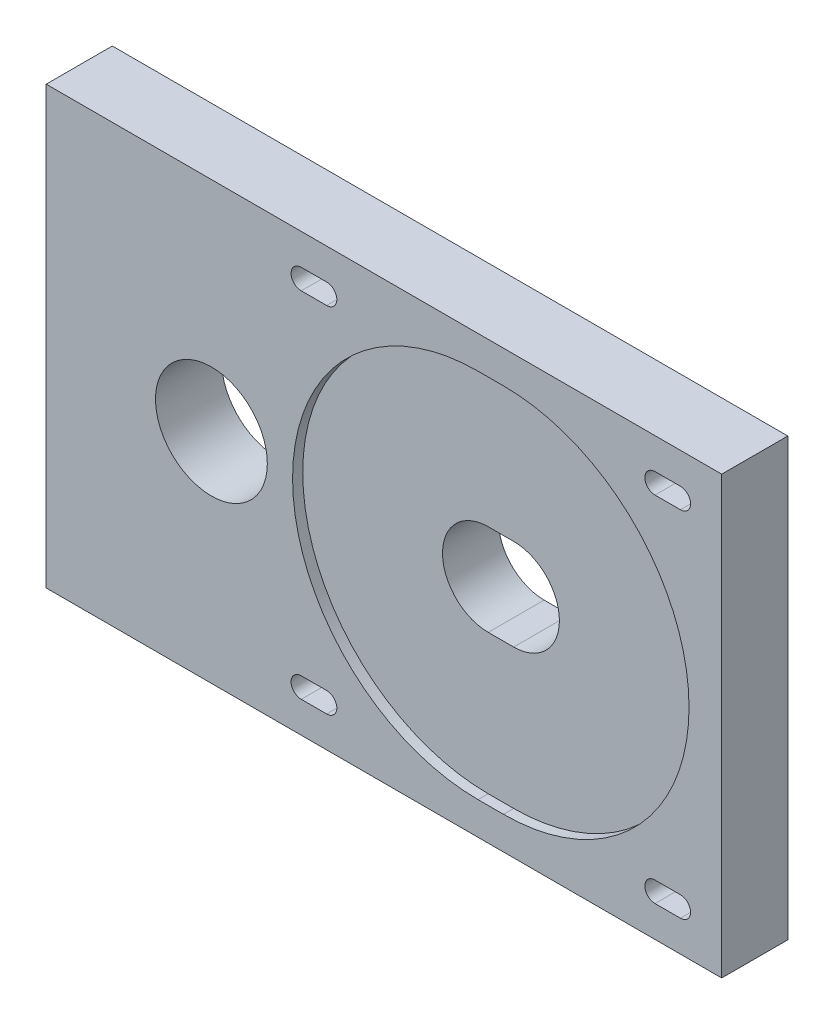
ISO-10303-21;
HEADER;
FILE_DESCRIPTION(('STEP AP214'),'2;1');
FILE_NAME('part.step','',(''),(''),'','','');
FILE_SCHEMA(('AUTOMOTIVE_DESIGN { 1 0 10303 214 1 1 1 1 }'));
ENDSEC;
DATA;
#1=APPLICATION_CONTEXT('core data for automotive mechanical design processes');
#2=APPLICATION_PROTOCOL_DEFINITION('international standard','automotive_design',2000,#1);
#3=PRODUCT_CONTEXT('',#1,'mechanical');
#4=PRODUCT('Part','Part','',(#3));
#5=PRODUCT_RELATED_PRODUCT_CATEGORY('part','',(#4));
#6=PRODUCT_DEFINITION_FORMATION('','',#4);
#7=PRODUCT_DEFINITION_CONTEXT('part definition',#1,'design');
#8=PRODUCT_DEFINITION('design','',#6,#7);
#9=PRODUCT_DEFINITION_SHAPE('','',#8);
#10=(LENGTH_UNIT() NAMED_UNIT(*) SI_UNIT(.MILLI.,.METRE.));
#11=(NAMED_UNIT(*) PLANE_ANGLE_UNIT() SI_UNIT($,.RADIAN.));
#12=(NAMED_UNIT(*) SI_UNIT($,.STERADIAN.) SOLID_ANGLE_UNIT());
#13=UNCERTAINTY_MEASURE_WITH_UNIT(LENGTH_MEASURE(1.E-05),#10,'distance_accuracy_value','');
#14=(GEOMETRIC_REPRESENTATION_CONTEXT(3) GLOBAL_UNCERTAINTY_ASSIGNED_CONTEXT((#13)) GLOBAL_UNIT_ASSIGNED_CONTEXT((#10,
#11,#12)) REPRESENTATION_CONTEXT('',''));
#15=CARTESIAN_POINT('',(0.,0.,0.));
#16=DIRECTION('',(0.,0.,1.));
#17=DIRECTION('',(1.,0.,0.));
#18=AXIS2_PLACEMENT_3D('',#15,#16,#17);
#19=CARTESIAN_POINT('',(-66.45,-42.925,13.));
#20=DIRECTION('',(1.,0.,0.));
#21=DIRECTION('',(0.,0.,-1.));
#22=AXIS2_PLACEMENT_3D('',#19,#20,#21);
#23=PLANE('',#22);
#24=CARTESIAN_POINT('',(-66.45,34.925,6.5));
#25=DIRECTION('',(-1.,0.,0.));
#26=DIRECTION('',(0.,0.,1.));
#27=AXIS2_PLACEMENT_3D('',#24,#25,#26);
#28=CIRCLE('',#27,3.);
#29=CARTESIAN_POINT('',(-66.45,34.925,9.5));
#30=VERTEX_POINT('',#29);
#31=EDGE_CURVE('E484',#30,#30,#28,.T.);
#32=ORIENTED_EDGE('',*,*,#31,.F.);
#33=EDGE_LOOP('',(#32));
#34=FACE_BOUND('',#33,.T.);
#35=CARTESIAN_POINT('',(-66.45,-34.925,6.5));
#36=DIRECTION('',(-1.,0.,0.));
#37=DIRECTION('',(0.,0.,1.));
#38=AXIS2_PLACEMENT_3D('',#35,#36,#37);
#39=CIRCLE('',#38,3.);
#40=CARTESIAN_POINT('',(-66.45,-34.925,9.5));
#41=VERTEX_POINT('',#40);
#42=EDGE_CURVE('E488',#41,#41,#39,.T.);
#43=ORIENTED_EDGE('',*,*,#42,.F.);
#44=EDGE_LOOP('',(#43));
#45=FACE_BOUND('',#44,.T.);
#46=DIRECTION('',(0.,-1.,0.));
#47=VECTOR('',#46,1.);
#48=CARTESIAN_POINT('',(-66.45,-42.925,0.));
#49=LINE('',#48,#47);
#50=CARTESIAN_POINT('',(-66.45,42.925,0.));
#51=VERTEX_POINT('',#50);
#52=CARTESIAN_POINT('',(-66.45,-42.925,0.));
#53=VERTEX_POINT('',#52);
#54=EDGE_CURVE('E401',#51,#53,#49,.T.);
#55=ORIENTED_EDGE('',*,*,#54,.T.);
#56=DIRECTION('',(0.,0.,-1.));
#57=VECTOR('',#56,1.);
#58=CARTESIAN_POINT('',(-66.45,-42.925,13.));
#59=LINE('',#58,#57);
#60=CARTESIAN_POINT('',(-66.45,-42.925,13.));
#61=VERTEX_POINT('',#60);
#62=EDGE_CURVE('E449',#61,#53,#59,.T.);
#63=ORIENTED_EDGE('',*,*,#62,.F.);
#64=DIRECTION('',(0.,-1.,0.));
#65=VECTOR('',#64,1.);
#66=CARTESIAN_POINT('',(-66.45,-42.925,13.));
#67=LINE('',#66,#65);
#68=CARTESIAN_POINT('',(-66.45,42.925,13.));
#69=VERTEX_POINT('',#68);
#70=EDGE_CURVE('E423',#69,#61,#67,.T.);
#71=ORIENTED_EDGE('',*,*,#70,.F.);
#72=DIRECTION('',(0.,0.,-1.));
#73=VECTOR('',#72,1.);
#74=CARTESIAN_POINT('',(-66.45,42.925,13.));
#75=LINE('',#74,#73);
#76=EDGE_CURVE('E433',#69,#51,#75,.T.);
#77=ORIENTED_EDGE('',*,*,#76,.T.);
#78=EDGE_LOOP('',(#55,#63,#71,#77));
#79=FACE_BOUND('',#78,.T.);
#80=ADVANCED_FACE('F51',(#34,#45,#79),#23,.F.);
#81=CARTESIAN_POINT('',(66.45,-42.925,13.));
#82=DIRECTION('',(0.,1.,0.));
#83=DIRECTION('',(-1.,0.,0.));
#84=AXIS2_PLACEMENT_3D('',#81,#82,#83);
#85=PLANE('',#84);
#86=DIRECTION('',(1.,0.,0.));
#87=VECTOR('',#86,1.);
#88=CARTESIAN_POINT('',(66.45,-42.925,0.));
#89=LINE('',#88,#87);
#90=CARTESIAN_POINT('',(66.45,-42.925,0.));
#91=VERTEX_POINT('',#90);
#92=EDGE_CURVE('E436',#53,#91,#89,.T.);
#93=ORIENTED_EDGE('',*,*,#92,.T.);
#94=DIRECTION('',(0.,0.,-1.));
#95=VECTOR('',#94,1.);
#96=CARTESIAN_POINT('',(66.45,-42.925,13.));
#97=LINE('',#96,#95);
#98=CARTESIAN_POINT('',(66.45,-42.925,13.));
#99=VERTEX_POINT('',#98);
#100=EDGE_CURVE('E446',#99,#91,#97,.T.);
#101=ORIENTED_EDGE('',*,*,#100,.F.);
#102=DIRECTION('',(1.,0.,0.));
#103=VECTOR('',#102,1.);
#104=CARTESIAN_POINT('',(66.45,-42.925,13.));
#105=LINE('',#104,#103);
#106=EDGE_CURVE('E426',#61,#99,#105,.T.);
#107=ORIENTED_EDGE('',*,*,#106,.F.);
#108=ORIENTED_EDGE('',*,*,#62,.T.);
#109=EDGE_LOOP('',(#93,#101,#107,#108));
#110=FACE_BOUND('',#109,.T.);
#111=ADVANCED_FACE('F474',(#110),#85,.F.);
#112=CARTESIAN_POINT('',(66.45,-42.925,13.));
#113=DIRECTION('',(-1.,0.,0.));
#114=DIRECTION('',(0.,0.,1.));
#115=AXIS2_PLACEMENT_3D('',#112,#113,#114);
#116=PLANE('',#115);
#117=DIRECTION('',(0.,1.,0.));
#118=VECTOR('',#117,1.);
#119=CARTESIAN_POINT('',(66.45,-42.925,0.));
#120=LINE('',#119,#118);
#121=CARTESIAN_POINT('',(66.45,42.925,0.));
#122=VERTEX_POINT('',#121);
#123=EDGE_CURVE('E438',#91,#122,#120,.T.);
#124=ORIENTED_EDGE('',*,*,#123,.T.);
#125=DIRECTION('',(0.,0.,-1.));
#126=VECTOR('',#125,1.);
#127=CARTESIAN_POINT('',(66.45,42.925,13.));
#128=LINE('',#127,#126);
#129=CARTESIAN_POINT('',(66.45,42.925,13.));
#130=VERTEX_POINT('',#129);
#131=EDGE_CURVE('E443',#130,#122,#128,.T.);
#132=ORIENTED_EDGE('',*,*,#131,.F.);
#133=DIRECTION('',(0.,1.,0.));
#134=VECTOR('',#133,1.);
#135=CARTESIAN_POINT('',(66.45,-42.925,13.));
#136=LINE('',#135,#134);
#137=EDGE_CURVE('E429',#99,#130,#136,.T.);
#138=ORIENTED_EDGE('',*,*,#137,.F.);
#139=ORIENTED_EDGE('',*,*,#100,.T.);
#140=EDGE_LOOP('',(#124,#132,#138,#139));
#141=FACE_BOUND('',#140,.T.);
#142=ADVANCED_FACE('F479',(#141),#116,.F.);
#143=CARTESIAN_POINT('',(66.45,42.925,13.));
#144=DIRECTION('',(0.,-1.,0.));
#145=DIRECTION('',(1.,0.,0.));
#146=AXIS2_PLACEMENT_3D('',#143,#144,#145);
#147=PLANE('',#146);
#148=DIRECTION('',(-1.,0.,0.));
#149=VECTOR('',#148,1.);
#150=CARTESIAN_POINT('',(66.45,42.925,0.));
#151=LINE('',#150,#149);
#152=EDGE_CURVE('E427',#122,#51,#151,.T.);
#153=ORIENTED_EDGE('',*,*,#152,.T.);
#154=ORIENTED_EDGE('',*,*,#76,.F.);
#155=DIRECTION('',(-1.,0.,0.));
#156=VECTOR('',#155,1.);
#157=CARTESIAN_POINT('',(66.45,42.925,13.));
#158=LINE('',#157,#156);
#159=EDGE_CURVE('E431',#130,#69,#158,.T.);
#160=ORIENTED_EDGE('',*,*,#159,.F.);
#161=ORIENTED_EDGE('',*,*,#131,.T.);
#162=EDGE_LOOP('',(#153,#154,#160,#161));
#163=FACE_BOUND('',#162,.T.);
#164=ADVANCED_FACE('F503',(#163),#147,.F.);
#165=CARTESIAN_POINT('',(0.,0.,13.));
#166=DIRECTION('',(0.,0.,1.));
#167=DIRECTION('',(1.,0.,0.));
#168=AXIS2_PLACEMENT_3D('',#165,#166,#167);
#169=PLANE('',#168);
#170=CARTESIAN_POINT('',(-33.95,0.,13.));
#171=DIRECTION('',(0.,0.,1.));
#172=DIRECTION('',(1.,0.,0.));
#173=AXIS2_PLACEMENT_3D('',#170,#171,#172);
#174=CIRCLE('',#173,11.);
#175=CARTESIAN_POINT('',(-22.95,0.,13.));
#176=VERTEX_POINT('',#175);
#177=EDGE_CURVE('E254',#176,#176,#174,.T.);
#178=ORIENTED_EDGE('',*,*,#177,.F.);
#179=EDGE_LOOP('',(#178));
#180=FACE_BOUND('',#179,.T.);
#181=CARTESIAN_POINT('',(-16.275,34.8,13.));
#182=DIRECTION('',(0.,0.,1.));
#183=DIRECTION('',(1.,0.,0.));
#184=AXIS2_PLACEMENT_3D('',#181,#182,#183);
#185=CIRCLE('',#184,2.);
#186=CARTESIAN_POINT('',(-16.275,36.8,13.));
#187=VERTEX_POINT('',#186);
#188=CARTESIAN_POINT('',(-16.275,32.8,13.));
#189=VERTEX_POINT('',#188);
#190=EDGE_CURVE('E280',#187,#189,#185,.T.);
#191=ORIENTED_EDGE('',*,*,#190,.F.);
#192=DIRECTION('',(1.,0.,0.));
#193=VECTOR('',#192,1.);
#194=CARTESIAN_POINT('',(-69.6,36.8,13.));
#195=LINE('',#194,#193);
#196=CARTESIAN_POINT('',(-11.275,36.8,13.));
#197=VERTEX_POINT('',#196);
#198=EDGE_CURVE('E271',#187,#197,#195,.T.);
#199=ORIENTED_EDGE('',*,*,#198,.T.);
#200=CARTESIAN_POINT('',(-11.275,34.8,13.));
#201=DIRECTION('',(0.,0.,1.));
#202=DIRECTION('',(1.,0.,0.));
#203=AXIS2_PLACEMENT_3D('',#200,#201,#202);
#204=CIRCLE('',#203,2.);
#205=CARTESIAN_POINT('',(-11.275,32.8,13.));
#206=VERTEX_POINT('',#205);
#207=EDGE_CURVE('E286',#206,#197,#204,.T.);
#208=ORIENTED_EDGE('',*,*,#207,.F.);
#209=DIRECTION('',(1.,0.,0.));
#210=VECTOR('',#209,1.);
#211=CARTESIAN_POINT('',(-69.6,32.8,13.));
#212=LINE('',#211,#210);
#213=EDGE_CURVE('E282',#189,#206,#212,.T.);
#214=ORIENTED_EDGE('',*,*,#213,.F.);
#215=EDGE_LOOP('',(#191,#199,#208,#214));
#216=FACE_BOUND('',#215,.T.);
#217=CARTESIAN_POINT('',(53.325,-34.8,13.));
#218=DIRECTION('',(0.,0.,1.));
#219=DIRECTION('',(1.,0.,0.));
#220=AXIS2_PLACEMENT_3D('',#217,#218,#219);
#221=CIRCLE('',#220,2.);
#222=CARTESIAN_POINT('',(53.325,-32.8,13.));
#223=VERTEX_POINT('',#222);
#224=CARTESIAN_POINT('',(53.325,-36.8,13.));
#225=VERTEX_POINT('',#224);
#226=EDGE_CURVE('E313',#223,#225,#221,.T.);
#227=ORIENTED_EDGE('',*,*,#226,.F.);
#228=DIRECTION('',(1.,0.,0.));
#229=VECTOR('',#228,1.);
#230=CARTESIAN_POINT('',(0.,-32.8,13.));
#231=LINE('',#230,#229);
#232=CARTESIAN_POINT('',(58.325,-32.8,13.));
#233=VERTEX_POINT('',#232);
#234=EDGE_CURVE('E304',#223,#233,#231,.T.);
#235=ORIENTED_EDGE('',*,*,#234,.T.);
#236=CARTESIAN_POINT('',(58.325,-34.8,13.));
#237=DIRECTION('',(0.,0.,1.));
#238=DIRECTION('',(1.,0.,0.));
#239=AXIS2_PLACEMENT_3D('',#236,#237,#238);
#240=CIRCLE('',#239,2.);
#241=CARTESIAN_POINT('',(58.325,-36.8,13.));
#242=VERTEX_POINT('',#241);
#243=EDGE_CURVE('E319',#242,#233,#240,.T.);
#244=ORIENTED_EDGE('',*,*,#243,.F.);
#245=DIRECTION('',(1.,0.,0.));
#246=VECTOR('',#245,1.);
#247=CARTESIAN_POINT('',(0.,-36.8,13.));
#248=LINE('',#247,#246);
#249=EDGE_CURVE('E315',#225,#242,#248,.T.);
#250=ORIENTED_EDGE('',*,*,#249,.F.);
#251=EDGE_LOOP('',(#227,#235,#244,#250));
#252=FACE_BOUND('',#251,.T.);
#253=CARTESIAN_POINT('',(-16.275,-34.8,13.));
#254=DIRECTION('',(0.,0.,1.));
#255=DIRECTION('',(1.,0.,0.));
#256=AXIS2_PLACEMENT_3D('',#253,#254,#255);
#257=CIRCLE('',#256,2.);
#258=CARTESIAN_POINT('',(-16.275,-32.8,13.));
#259=VERTEX_POINT('',#258);
#260=CARTESIAN_POINT('',(-16.275,-36.8,13.));
#261=VERTEX_POINT('',#260);
#262=EDGE_CURVE('E262',#259,#261,#257,.T.);
#263=ORIENTED_EDGE('',*,*,#262,.F.);
#264=DIRECTION('',(1.,0.,0.));
#265=VECTOR('',#264,1.);
#266=CARTESIAN_POINT('',(-69.6,-32.8,13.));
#267=LINE('',#266,#265);
#268=CARTESIAN_POINT('',(-11.275,-32.8,13.));
#269=VERTEX_POINT('',#268);
#270=EDGE_CURVE('E335',#259,#269,#267,.T.);
#271=ORIENTED_EDGE('',*,*,#270,.T.);
#272=CARTESIAN_POINT('',(-11.275,-34.8,13.));
#273=DIRECTION('',(0.,0.,1.));
#274=DIRECTION('',(1.,0.,0.));
#275=AXIS2_PLACEMENT_3D('',#272,#273,#274);
#276=CIRCLE('',#275,2.);
#277=CARTESIAN_POINT('',(-11.275,-36.8,13.));
#278=VERTEX_POINT('',#277);
#279=EDGE_CURVE('E348',#278,#269,#276,.T.);
#280=ORIENTED_EDGE('',*,*,#279,.F.);
#281=DIRECTION('',(1.,0.,0.));
#282=VECTOR('',#281,1.);
#283=CARTESIAN_POINT('',(-69.6,-36.8,13.));
#284=LINE('',#283,#282);
#285=EDGE_CURVE('E345',#261,#278,#284,.T.);
#286=ORIENTED_EDGE('',*,*,#285,.F.);
#287=EDGE_LOOP('',(#263,#271,#280,#286));
#288=FACE_BOUND('',#287,.T.);
#289=CARTESIAN_POINT('',(53.325,34.8,13.));
#290=DIRECTION('',(0.,0.,1.));
#291=DIRECTION('',(1.,0.,0.));
#292=AXIS2_PLACEMENT_3D('',#289,#290,#291);
#293=CIRCLE('',#292,2.);
#294=CARTESIAN_POINT('',(53.325,36.8,13.));
#295=VERTEX_POINT('',#294);
#296=CARTESIAN_POINT('',(53.325,32.8,13.));
#297=VERTEX_POINT('',#296);
#298=EDGE_CURVE('E293',#295,#297,#293,.T.);
#299=ORIENTED_EDGE('',*,*,#298,.F.);
#300=DIRECTION('',(1.,0.,0.));
#301=VECTOR('',#300,1.);
#302=CARTESIAN_POINT('',(0.,36.8,13.));
#303=LINE('',#302,#301);
#304=CARTESIAN_POINT('',(58.325,36.8,13.));
#305=VERTEX_POINT('',#304);
#306=EDGE_CURVE('E364',#295,#305,#303,.T.);
#307=ORIENTED_EDGE('',*,*,#306,.T.);
#308=CARTESIAN_POINT('',(58.325,34.8,13.));
#309=DIRECTION('',(0.,0.,1.));
#310=DIRECTION('',(1.,0.,0.));
#311=AXIS2_PLACEMENT_3D('',#308,#309,#310);
#312=CIRCLE('',#311,2.);
#313=CARTESIAN_POINT('',(58.325,32.8,13.));
#314=VERTEX_POINT('',#313);
#315=EDGE_CURVE('E377',#314,#305,#312,.T.);
#316=ORIENTED_EDGE('',*,*,#315,.F.);
#317=DIRECTION('',(1.,0.,0.));
#318=VECTOR('',#317,1.);
#319=CARTESIAN_POINT('',(0.,32.8,13.));
#320=LINE('',#319,#318);
#321=EDGE_CURVE('E374',#297,#314,#320,.T.);
#322=ORIENTED_EDGE('',*,*,#321,.F.);
#323=EDGE_LOOP('',(#299,#307,#316,#322));
#324=FACE_BOUND('',#323,.T.);
#325=DIRECTION('',(-1.,0.,0.));
#326=VECTOR('',#325,1.);
#327=CARTESIAN_POINT('',(23.52,36.5,13.));
#328=LINE('',#327,#326);
#329=CARTESIAN_POINT('',(23.52,36.5,13.));
#330=VERTEX_POINT('',#329);
#331=CARTESIAN_POINT('',(18.52,36.5,13.));
#332=VERTEX_POINT('',#331);
#333=EDGE_CURVE('E416',#330,#332,#328,.T.);
#334=ORIENTED_EDGE('',*,*,#333,.F.);
#335=CARTESIAN_POINT('',(23.52,0.,13.));
#336=DIRECTION('',(0.,0.,1.));
#337=DIRECTION('',(1.,0.,0.));
#338=AXIS2_PLACEMENT_3D('',#335,#336,#337);
#339=CIRCLE('',#338,36.5);
#340=CARTESIAN_POINT('',(23.52,-36.5,13.));
#341=VERTEX_POINT('',#340);
#342=EDGE_CURVE('E395',#341,#330,#339,.T.);
#343=ORIENTED_EDGE('',*,*,#342,.F.);
#344=DIRECTION('',(-1.,0.,0.));
#345=VECTOR('',#344,1.);
#346=CARTESIAN_POINT('',(23.52,-36.5,13.));
#347=LINE('',#346,#345);
#348=CARTESIAN_POINT('',(18.52,-36.5,13.));
#349=VERTEX_POINT('',#348);
#350=EDGE_CURVE('E384',#341,#349,#347,.T.);
#351=ORIENTED_EDGE('',*,*,#350,.T.);
#352=CARTESIAN_POINT('',(18.52,0.,13.));
#353=DIRECTION('',(0.,0.,1.));
#354=DIRECTION('',(1.,0.,0.));
#355=AXIS2_PLACEMENT_3D('',#352,#353,#354);
#356=CIRCLE('',#355,36.5);
#357=EDGE_CURVE('E407',#332,#349,#356,.T.);
#358=ORIENTED_EDGE('',*,*,#357,.F.);
#359=EDGE_LOOP('',(#334,#343,#351,#358));
#360=FACE_BOUND('',#359,.T.);
#361=ORIENTED_EDGE('',*,*,#70,.T.);
#362=ORIENTED_EDGE('',*,*,#106,.T.);
#363=ORIENTED_EDGE('',*,*,#137,.T.);
#364=ORIENTED_EDGE('',*,*,#159,.T.);
#365=EDGE_LOOP('',(#361,#362,#363,#364));
#366=FACE_BOUND('',#365,.T.);
#367=ADVANCED_FACE('F499',(#180,#216,#252,#288,#324,#360,#366),#169,.T.);
#368=CARTESIAN_POINT('',(0.,0.,0.));
#369=DIRECTION('',(0.,0.,1.));
#370=DIRECTION('',(1.,0.,0.));
#371=AXIS2_PLACEMENT_3D('',#368,#369,#370);
#372=PLANE('',#371);
#373=CARTESIAN_POINT('',(-33.95,0.,0.));
#374=DIRECTION('',(0.,0.,1.));
#375=DIRECTION('',(1.,0.,0.));
#376=AXIS2_PLACEMENT_3D('',#373,#374,#375);
#377=CIRCLE('',#376,11.);
#378=CARTESIAN_POINT('',(-22.95,0.,0.));
#379=VERTEX_POINT('',#378);
#380=EDGE_CURVE('E251',#379,#379,#377,.T.);
#381=ORIENTED_EDGE('',*,*,#380,.T.);
#382=EDGE_LOOP('',(#381));
#383=FACE_BOUND('',#382,.T.);
#384=CARTESIAN_POINT('',(18.52,0.,0.));
#385=DIRECTION('',(0.,0.,1.));
#386=DIRECTION('',(1.,0.,0.));
#387=AXIS2_PLACEMENT_3D('',#384,#385,#386);
#388=CIRCLE('',#387,9.);
#389=CARTESIAN_POINT('',(18.52,9.,0.));
#390=VERTEX_POINT('',#389);
#391=CARTESIAN_POINT('',(18.52,-9.,0.));
#392=VERTEX_POINT('',#391);
#393=EDGE_CURVE('E239',#390,#392,#388,.T.);
#394=ORIENTED_EDGE('',*,*,#393,.T.);
#395=DIRECTION('',(1.,0.,0.));
#396=VECTOR('',#395,1.);
#397=CARTESIAN_POINT('',(0.,-9.,0.));
#398=LINE('',#397,#396);
#399=CARTESIAN_POINT('',(23.52,-9.,0.));
#400=VERTEX_POINT('',#399);
#401=EDGE_CURVE('E235',#392,#400,#398,.T.);
#402=ORIENTED_EDGE('',*,*,#401,.T.);
#403=CARTESIAN_POINT('',(23.52,0.,0.));
#404=DIRECTION('',(0.,0.,1.));
#405=DIRECTION('',(1.,0.,0.));
#406=AXIS2_PLACEMENT_3D('',#403,#404,#405);
#407=CIRCLE('',#406,9.);
#408=CARTESIAN_POINT('',(23.52,9.,0.));
#409=VERTEX_POINT('',#408);
#410=EDGE_CURVE('E242',#400,#409,#407,.T.);
#411=ORIENTED_EDGE('',*,*,#410,.T.);
#412=DIRECTION('',(1.,0.,0.));
#413=VECTOR('',#412,1.);
#414=CARTESIAN_POINT('',(0.,9.,0.));
#415=LINE('',#414,#413);
#416=EDGE_CURVE('E246',#390,#409,#415,.T.);
#417=ORIENTED_EDGE('',*,*,#416,.F.);
#418=EDGE_LOOP('',(#394,#402,#411,#417));
#419=FACE_BOUND('',#418,.T.);
#420=DIRECTION('',(1.,0.,0.));
#421=VECTOR('',#420,1.);
#422=CARTESIAN_POINT('',(-69.6,36.8,0.));
#423=LINE('',#422,#421);
#424=CARTESIAN_POINT('',(-16.275,36.8,0.));
#425=VERTEX_POINT('',#424);
#426=CARTESIAN_POINT('',(-11.275,36.8,0.));
#427=VERTEX_POINT('',#426);
#428=EDGE_CURVE('E277',#425,#427,#423,.T.);
#429=ORIENTED_EDGE('',*,*,#428,.F.);
#430=CARTESIAN_POINT('',(-16.275,34.8,0.));
#431=DIRECTION('',(0.,0.,1.));
#432=DIRECTION('',(1.,0.,0.));
#433=AXIS2_PLACEMENT_3D('',#430,#431,#432);
#434=CIRCLE('',#433,2.);
#435=CARTESIAN_POINT('',(-16.275,32.8,0.));
#436=VERTEX_POINT('',#435);
#437=EDGE_CURVE('E267',#425,#436,#434,.T.);
#438=ORIENTED_EDGE('',*,*,#437,.T.);
#439=DIRECTION('',(1.,0.,0.));
#440=VECTOR('',#439,1.);
#441=CARTESIAN_POINT('',(-69.6,32.8,0.));
#442=LINE('',#441,#440);
#443=CARTESIAN_POINT('',(-11.275,32.8,0.));
#444=VERTEX_POINT('',#443);
#445=EDGE_CURVE('E270',#436,#444,#442,.T.);
#446=ORIENTED_EDGE('',*,*,#445,.T.);
#447=CARTESIAN_POINT('',(-11.275,34.8,0.));
#448=DIRECTION('',(0.,0.,1.));
#449=DIRECTION('',(1.,0.,0.));
#450=AXIS2_PLACEMENT_3D('',#447,#448,#449);
#451=CIRCLE('',#450,2.);
#452=EDGE_CURVE('E274',#444,#427,#451,.T.);
#453=ORIENTED_EDGE('',*,*,#452,.T.);
#454=EDGE_LOOP('',(#429,#438,#446,#453));
#455=FACE_BOUND('',#454,.T.);
#456=DIRECTION('',(1.,0.,0.));
#457=VECTOR('',#456,1.);
#458=CARTESIAN_POINT('',(0.,-32.8,0.));
#459=LINE('',#458,#457);
#460=CARTESIAN_POINT('',(53.325,-32.8,0.));
#461=VERTEX_POINT('',#460);
#462=CARTESIAN_POINT('',(58.325,-32.8,0.));
#463=VERTEX_POINT('',#462);
#464=EDGE_CURVE('E310',#461,#463,#459,.T.);
#465=ORIENTED_EDGE('',*,*,#464,.F.);
#466=CARTESIAN_POINT('',(53.325,-34.8,0.));
#467=DIRECTION('',(0.,0.,1.));
#468=DIRECTION('',(1.,0.,0.));
#469=AXIS2_PLACEMENT_3D('',#466,#467,#468);
#470=CIRCLE('',#469,2.);
#471=CARTESIAN_POINT('',(53.325,-36.8,0.));
#472=VERTEX_POINT('',#471);
#473=EDGE_CURVE('E300',#461,#472,#470,.T.);
#474=ORIENTED_EDGE('',*,*,#473,.T.);
#475=DIRECTION('',(1.,0.,0.));
#476=VECTOR('',#475,1.);
#477=CARTESIAN_POINT('',(0.,-36.8,0.));
#478=LINE('',#477,#476);
#479=CARTESIAN_POINT('',(58.325,-36.8,0.));
#480=VERTEX_POINT('',#479);
#481=EDGE_CURVE('E303',#472,#480,#478,.T.);
#482=ORIENTED_EDGE('',*,*,#481,.T.);
#483=CARTESIAN_POINT('',(58.325,-34.8,0.));
#484=DIRECTION('',(0.,0.,1.));
#485=DIRECTION('',(1.,0.,0.));
#486=AXIS2_PLACEMENT_3D('',#483,#484,#485);
#487=CIRCLE('',#486,2.);
#488=EDGE_CURVE('E307',#480,#463,#487,.T.);
#489=ORIENTED_EDGE('',*,*,#488,.T.);
#490=EDGE_LOOP('',(#465,#474,#482,#489));
#491=FACE_BOUND('',#490,.T.);
#492=DIRECTION('',(1.,0.,0.));
#493=VECTOR('',#492,1.);
#494=CARTESIAN_POINT('',(-69.6,-32.8,0.));
#495=LINE('',#494,#493);
#496=CARTESIAN_POINT('',(-16.275,-32.8,0.));
#497=VERTEX_POINT('',#496);
#498=CARTESIAN_POINT('',(-11.275,-32.8,0.));
#499=VERTEX_POINT('',#498);
#500=EDGE_CURVE('E341',#497,#499,#495,.T.);
#501=ORIENTED_EDGE('',*,*,#500,.F.);
#502=CARTESIAN_POINT('',(-16.275,-34.8,0.));
#503=DIRECTION('',(0.,0.,1.));
#504=DIRECTION('',(1.,0.,0.));
#505=AXIS2_PLACEMENT_3D('',#502,#503,#504);
#506=CIRCLE('',#505,2.);
#507=CARTESIAN_POINT('',(-16.275,-36.8,0.));
#508=VERTEX_POINT('',#507);
#509=EDGE_CURVE('E331',#497,#508,#506,.T.);
#510=ORIENTED_EDGE('',*,*,#509,.T.);
#511=DIRECTION('',(1.,0.,0.));
#512=VECTOR('',#511,1.);
#513=CARTESIAN_POINT('',(-69.6,-36.8,0.));
#514=LINE('',#513,#512);
#515=CARTESIAN_POINT('',(-11.275,-36.8,0.));
#516=VERTEX_POINT('',#515);
#517=EDGE_CURVE('E334',#508,#516,#514,.T.);
#518=ORIENTED_EDGE('',*,*,#517,.T.);
#519=CARTESIAN_POINT('',(-11.275,-34.8,0.));
#520=DIRECTION('',(0.,0.,1.));
#521=DIRECTION('',(1.,0.,0.));
#522=AXIS2_PLACEMENT_3D('',#519,#520,#521);
#523=CIRCLE('',#522,2.);
#524=EDGE_CURVE('E338',#516,#499,#523,.T.);
#525=ORIENTED_EDGE('',*,*,#524,.T.);
#526=EDGE_LOOP('',(#501,#510,#518,#525));
#527=FACE_BOUND('',#526,.T.);
#528=DIRECTION('',(1.,0.,0.));
#529=VECTOR('',#528,1.);
#530=CARTESIAN_POINT('',(0.,36.8,0.));
#531=LINE('',#530,#529);
#532=CARTESIAN_POINT('',(53.325,36.8,0.));
#533=VERTEX_POINT('',#532);
#534=CARTESIAN_POINT('',(58.325,36.8,0.));
#535=VERTEX_POINT('',#534);
#536=EDGE_CURVE('E370',#533,#535,#531,.T.);
#537=ORIENTED_EDGE('',*,*,#536,.F.);
#538=CARTESIAN_POINT('',(53.325,34.8,0.));
#539=DIRECTION('',(0.,0.,1.));
#540=DIRECTION('',(1.,0.,0.));
#541=AXIS2_PLACEMENT_3D('',#538,#539,#540);
#542=CIRCLE('',#541,2.);
#543=CARTESIAN_POINT('',(53.325,32.8,0.));
#544=VERTEX_POINT('',#543);
#545=EDGE_CURVE('E360',#533,#544,#542,.T.);
#546=ORIENTED_EDGE('',*,*,#545,.T.);
#547=DIRECTION('',(1.,0.,0.));
#548=VECTOR('',#547,1.);
#549=CARTESIAN_POINT('',(0.,32.8,0.));
#550=LINE('',#549,#548);
#551=CARTESIAN_POINT('',(58.325,32.8,0.));
#552=VERTEX_POINT('',#551);
#553=EDGE_CURVE('E363',#544,#552,#550,.T.);
#554=ORIENTED_EDGE('',*,*,#553,.T.);
#555=CARTESIAN_POINT('',(58.325,34.8,0.));
#556=DIRECTION('',(0.,0.,1.));
#557=DIRECTION('',(1.,0.,0.));
#558=AXIS2_PLACEMENT_3D('',#555,#556,#557);
#559=CIRCLE('',#558,2.);
#560=EDGE_CURVE('E367',#552,#535,#559,.T.);
#561=ORIENTED_EDGE('',*,*,#560,.T.);
#562=EDGE_LOOP('',(#537,#546,#554,#561));
#563=FACE_BOUND('',#562,.T.);
#564=ORIENTED_EDGE('',*,*,#54,.F.);
#565=ORIENTED_EDGE('',*,*,#152,.F.);
#566=ORIENTED_EDGE('',*,*,#123,.F.);
#567=ORIENTED_EDGE('',*,*,#92,.F.);
#568=EDGE_LOOP('',(#564,#565,#566,#567));
#569=FACE_BOUND('',#568,.T.);
#570=ADVANCED_FACE('F248',(#383,#419,#455,#491,#527,#563,#569),#372,.F.);
#571=CARTESIAN_POINT('',(23.52,0.,11.));
#572=DIRECTION('',(0.,0.,1.));
#573=DIRECTION('',(1.,0.,0.));
#574=AXIS2_PLACEMENT_3D('',#571,#572,#573);
#575=CYLINDRICAL_SURFACE('',#574,36.5);
#576=ORIENTED_EDGE('',*,*,#342,.T.);
#577=DIRECTION('',(0.,0.,1.));
#578=VECTOR('',#577,1.);
#579=CARTESIAN_POINT('',(23.52,36.5,11.));
#580=LINE('',#579,#578);
#581=CARTESIAN_POINT('',(23.52,36.5,11.));
#582=VERTEX_POINT('',#581);
#583=EDGE_CURVE('E399',#582,#330,#580,.T.);
#584=ORIENTED_EDGE('',*,*,#583,.F.);
#585=CARTESIAN_POINT('',(23.52,0.,11.));
#586=DIRECTION('',(0.,0.,1.));
#587=DIRECTION('',(1.,0.,0.));
#588=AXIS2_PLACEMENT_3D('',#585,#586,#587);
#589=CIRCLE('',#588,36.5);
#590=CARTESIAN_POINT('',(23.52,-36.5,11.));
#591=VERTEX_POINT('',#590);
#592=EDGE_CURVE('E391',#591,#582,#589,.T.);
#593=ORIENTED_EDGE('',*,*,#592,.F.);
#594=DIRECTION('',(0.,0.,1.));
#595=VECTOR('',#594,1.);
#596=CARTESIAN_POINT('',(23.52,-36.5,11.));
#597=LINE('',#596,#595);
#598=EDGE_CURVE('E394',#591,#341,#597,.T.);
#599=ORIENTED_EDGE('',*,*,#598,.T.);
#600=EDGE_LOOP('',(#576,#584,#593,#599));
#601=FACE_BOUND('',#600,.T.);
#602=ADVANCED_FACE('F514',(#601),#575,.F.);
#603=CARTESIAN_POINT('',(0.,0.,11.));
#604=DIRECTION('',(0.,0.,1.));
#605=DIRECTION('',(1.,0.,0.));
#606=AXIS2_PLACEMENT_3D('',#603,#604,#605);
#607=PLANE('',#606);
#608=DIRECTION('',(1.,0.,0.));
#609=VECTOR('',#608,1.);
#610=CARTESIAN_POINT('',(0.,-9.,11.));
#611=LINE('',#610,#609);
#612=CARTESIAN_POINT('',(18.52,-9.,11.));
#613=VERTEX_POINT('',#612);
#614=CARTESIAN_POINT('',(23.52,-9.,11.));
#615=VERTEX_POINT('',#614);
#616=EDGE_CURVE('E12',#613,#615,#611,.T.);
#617=ORIENTED_EDGE('',*,*,#616,.F.);
#618=CARTESIAN_POINT('',(18.52,0.,11.));
#619=DIRECTION('',(0.,0.,1.));
#620=DIRECTION('',(1.,0.,0.));
#621=AXIS2_PLACEMENT_3D('',#618,#619,#620);
#622=CIRCLE('',#621,9.);
#623=CARTESIAN_POINT('',(18.52,9.,11.));
#624=VERTEX_POINT('',#623);
#625=EDGE_CURVE('E58',#624,#613,#622,.T.);
#626=ORIENTED_EDGE('',*,*,#625,.F.);
#627=DIRECTION('',(1.,0.,0.));
#628=VECTOR('',#627,1.);
#629=CARTESIAN_POINT('',(0.,9.,11.));
#630=LINE('',#629,#628);
#631=CARTESIAN_POINT('',(23.52,9.,11.));
#632=VERTEX_POINT('',#631);
#633=EDGE_CURVE('E454',#624,#632,#630,.T.);
#634=ORIENTED_EDGE('',*,*,#633,.T.);
#635=CARTESIAN_POINT('',(23.52,0.,11.));
#636=DIRECTION('',(0.,0.,1.));
#637=DIRECTION('',(1.,0.,0.));
#638=AXIS2_PLACEMENT_3D('',#635,#636,#637);
#639=CIRCLE('',#638,9.);
#640=EDGE_CURVE('E452',#615,#632,#639,.T.);
#641=ORIENTED_EDGE('',*,*,#640,.F.);
#642=EDGE_LOOP('',(#617,#626,#634,#641));
#643=FACE_BOUND('',#642,.T.);
#644=ORIENTED_EDGE('',*,*,#592,.T.);
#645=DIRECTION('',(-1.,0.,0.));
#646=VECTOR('',#645,1.);
#647=CARTESIAN_POINT('',(23.52,36.5,11.));
#648=LINE('',#647,#646);
#649=CARTESIAN_POINT('',(18.52,36.5,11.));
#650=VERTEX_POINT('',#649);
#651=EDGE_CURVE('E409',#582,#650,#648,.T.);
#652=ORIENTED_EDGE('',*,*,#651,.T.);
#653=CARTESIAN_POINT('',(18.52,0.,11.));
#654=DIRECTION('',(0.,0.,1.));
#655=DIRECTION('',(1.,0.,0.));
#656=AXIS2_PLACEMENT_3D('',#653,#654,#655);
#657=CIRCLE('',#656,36.5);
#658=CARTESIAN_POINT('',(18.52,-36.5,11.));
#659=VERTEX_POINT('',#658);
#660=EDGE_CURVE('E403',#650,#659,#657,.T.);
#661=ORIENTED_EDGE('',*,*,#660,.T.);
#662=DIRECTION('',(-1.,0.,0.));
#663=VECTOR('',#662,1.);
#664=CARTESIAN_POINT('',(23.52,-36.5,11.));
#665=LINE('',#664,#663);
#666=EDGE_CURVE('E413',#591,#659,#665,.T.);
#667=ORIENTED_EDGE('',*,*,#666,.F.);
#668=EDGE_LOOP('',(#644,#652,#661,#667));
#669=FACE_BOUND('',#668,.T.);
#670=ADVANCED_FACE('F460',(#643,#669),#607,.T.);
#671=CARTESIAN_POINT('',(18.52,0.,11.));
#672=DIRECTION('',(0.,0.,1.));
#673=DIRECTION('',(1.,0.,0.));
#674=AXIS2_PLACEMENT_3D('',#671,#672,#673);
#675=CYLINDRICAL_SURFACE('',#674,36.5);
#676=ORIENTED_EDGE('',*,*,#357,.T.);
#677=DIRECTION('',(0.,0.,1.));
#678=VECTOR('',#677,1.);
#679=CARTESIAN_POINT('',(18.52,-36.5,11.));
#680=LINE('',#679,#678);
#681=EDGE_CURVE('E398',#659,#349,#680,.T.);
#682=ORIENTED_EDGE('',*,*,#681,.F.);
#683=ORIENTED_EDGE('',*,*,#660,.F.);
#684=DIRECTION('',(0.,0.,1.));
#685=VECTOR('',#684,1.);
#686=CARTESIAN_POINT('',(18.52,36.5,11.));
#687=LINE('',#686,#685);
#688=EDGE_CURVE('E406',#650,#332,#687,.T.);
#689=ORIENTED_EDGE('',*,*,#688,.T.);
#690=EDGE_LOOP('',(#676,#682,#683,#689));
#691=FACE_BOUND('',#690,.T.);
#692=ADVANCED_FACE('F516',(#691),#675,.F.);
#693=CARTESIAN_POINT('',(23.52,36.5,11.));
#694=DIRECTION('',(0.,1.,0.));
#695=DIRECTION('',(0.,0.,1.));
#696=AXIS2_PLACEMENT_3D('',#693,#694,#695);
#697=PLANE('',#696);
#698=ORIENTED_EDGE('',*,*,#333,.T.);
#699=ORIENTED_EDGE('',*,*,#688,.F.);
#700=ORIENTED_EDGE('',*,*,#651,.F.);
#701=ORIENTED_EDGE('',*,*,#583,.T.);
#702=EDGE_LOOP('',(#698,#699,#700,#701));
#703=FACE_BOUND('',#702,.T.);
#704=ADVANCED_FACE('F524',(#703),#697,.F.);
#705=CARTESIAN_POINT('',(23.52,-36.5,11.));
#706=DIRECTION('',(0.,1.,0.));
#707=DIRECTION('',(0.,0.,1.));
#708=AXIS2_PLACEMENT_3D('',#705,#706,#707);
#709=PLANE('',#708);
#710=ORIENTED_EDGE('',*,*,#350,.F.);
#711=ORIENTED_EDGE('',*,*,#598,.F.);
#712=ORIENTED_EDGE('',*,*,#666,.T.);
#713=ORIENTED_EDGE('',*,*,#681,.T.);
#714=EDGE_LOOP('',(#710,#711,#712,#713));
#715=FACE_BOUND('',#714,.T.);
#716=ADVANCED_FACE('F520',(#715),#709,.T.);
#717=CARTESIAN_POINT('',(53.325,34.8,0.));
#718=DIRECTION('',(0.,0.,1.));
#719=DIRECTION('',(1.,0.,0.));
#720=AXIS2_PLACEMENT_3D('',#717,#718,#719);
#721=CYLINDRICAL_SURFACE('',#720,2.);
#722=ORIENTED_EDGE('',*,*,#298,.T.);
#723=DIRECTION('',(0.,0.,1.));
#724=VECTOR('',#723,1.);
#725=CARTESIAN_POINT('',(53.325,32.8,0.));
#726=LINE('',#725,#724);
#727=EDGE_CURVE('E372',#544,#297,#726,.T.);
#728=ORIENTED_EDGE('',*,*,#727,.F.);
#729=ORIENTED_EDGE('',*,*,#545,.F.);
#730=DIRECTION('',(0.,0.,1.));
#731=VECTOR('',#730,1.);
#732=CARTESIAN_POINT('',(53.325,36.8,0.));
#733=LINE('',#732,#731);
#734=EDGE_CURVE('E382',#533,#295,#733,.T.);
#735=ORIENTED_EDGE('',*,*,#734,.T.);
#736=EDGE_LOOP('',(#722,#728,#729,#735));
#737=FACE_BOUND('',#736,.T.);
#738=ADVANCED_FACE('F523',(#737),#721,.F.);
#739=CARTESIAN_POINT('',(0.,36.8,0.));
#740=DIRECTION('',(0.,-1.,0.));
#741=DIRECTION('',(0.,0.,-1.));
#742=AXIS2_PLACEMENT_3D('',#739,#740,#741);
#743=PLANE('',#742);
#744=ORIENTED_EDGE('',*,*,#306,.F.);
#745=ORIENTED_EDGE('',*,*,#734,.F.);
#746=ORIENTED_EDGE('',*,*,#536,.T.);
#747=DIRECTION('',(0.,0.,1.));
#748=VECTOR('',#747,1.);
#749=CARTESIAN_POINT('',(58.325,36.8,0.));
#750=LINE('',#749,#748);
#751=EDGE_CURVE('E385',#535,#305,#750,.T.);
#752=ORIENTED_EDGE('',*,*,#751,.T.);
#753=EDGE_LOOP('',(#744,#745,#746,#752));
#754=FACE_BOUND('',#753,.T.);
#755=ADVANCED_FACE('F539',(#754),#743,.T.);
#756=CARTESIAN_POINT('',(58.325,34.8,0.));
#757=DIRECTION('',(0.,0.,1.));
#758=DIRECTION('',(1.,0.,0.));
#759=AXIS2_PLACEMENT_3D('',#756,#757,#758);
#760=CYLINDRICAL_SURFACE('',#759,2.);
#761=ORIENTED_EDGE('',*,*,#315,.T.);
#762=ORIENTED_EDGE('',*,*,#751,.F.);
#763=ORIENTED_EDGE('',*,*,#560,.F.);
#764=DIRECTION('',(0.,0.,1.));
#765=VECTOR('',#764,1.);
#766=CARTESIAN_POINT('',(58.325,32.8,0.));
#767=LINE('',#766,#765);
#768=EDGE_CURVE('E387',#552,#314,#767,.T.);
#769=ORIENTED_EDGE('',*,*,#768,.T.);
#770=EDGE_LOOP('',(#761,#762,#763,#769));
#771=FACE_BOUND('',#770,.T.);
#772=ADVANCED_FACE('F545',(#771),#760,.F.);
#773=CARTESIAN_POINT('',(0.,32.8,0.));
#774=DIRECTION('',(0.,-1.,0.));
#775=DIRECTION('',(0.,0.,-1.));
#776=AXIS2_PLACEMENT_3D('',#773,#774,#775);
#777=PLANE('',#776);
#778=ORIENTED_EDGE('',*,*,#321,.T.);
#779=ORIENTED_EDGE('',*,*,#768,.F.);
#780=ORIENTED_EDGE('',*,*,#553,.F.);
#781=ORIENTED_EDGE('',*,*,#727,.T.);
#782=EDGE_LOOP('',(#778,#779,#780,#781));
#783=FACE_BOUND('',#782,.T.);
#784=ADVANCED_FACE('F541',(#783),#777,.F.);
#785=CARTESIAN_POINT('',(-16.275,-34.8,0.));
#786=DIRECTION('',(0.,0.,1.));
#787=DIRECTION('',(1.,0.,0.));
#788=AXIS2_PLACEMENT_3D('',#785,#786,#787);
#789=CYLINDRICAL_SURFACE('',#788,2.);
#790=ORIENTED_EDGE('',*,*,#262,.T.);
#791=DIRECTION('',(0.,0.,1.));
#792=VECTOR('',#791,1.);
#793=CARTESIAN_POINT('',(-16.275,-36.8,0.));
#794=LINE('',#793,#792);
#795=EDGE_CURVE('E343',#508,#261,#794,.T.);
#796=ORIENTED_EDGE('',*,*,#795,.F.);
#797=ORIENTED_EDGE('',*,*,#509,.F.);
#798=DIRECTION('',(0.,0.,1.));
#799=VECTOR('',#798,1.);
#800=CARTESIAN_POINT('',(-16.275,-32.8,0.));
#801=LINE('',#800,#799);
#802=EDGE_CURVE('E316',#497,#259,#801,.T.);
#803=ORIENTED_EDGE('',*,*,#802,.T.);
#804=EDGE_LOOP('',(#790,#796,#797,#803));
#805=FACE_BOUND('',#804,.T.);
#806=ADVANCED_FACE('F544',(#805),#789,.F.);
#807=CARTESIAN_POINT('',(-69.6,-32.8,0.));
#808=DIRECTION('',(0.,-1.,0.));
#809=DIRECTION('',(0.,0.,-1.));
#810=AXIS2_PLACEMENT_3D('',#807,#808,#809);
#811=PLANE('',#810);
#812=ORIENTED_EDGE('',*,*,#270,.F.);
#813=ORIENTED_EDGE('',*,*,#802,.F.);
#814=ORIENTED_EDGE('',*,*,#500,.T.);
#815=DIRECTION('',(0.,0.,1.));
#816=VECTOR('',#815,1.);
#817=CARTESIAN_POINT('',(-11.275,-32.8,0.));
#818=LINE('',#817,#816);
#819=EDGE_CURVE('E354',#499,#269,#818,.T.);
#820=ORIENTED_EDGE('',*,*,#819,.T.);
#821=EDGE_LOOP('',(#812,#813,#814,#820));
#822=FACE_BOUND('',#821,.T.);
#823=ADVANCED_FACE('F555',(#822),#811,.T.);
#824=CARTESIAN_POINT('',(-11.275,-34.8,0.));
#825=DIRECTION('',(0.,0.,1.));
#826=DIRECTION('',(1.,0.,0.));
#827=AXIS2_PLACEMENT_3D('',#824,#825,#826);
#828=CYLINDRICAL_SURFACE('',#827,2.);
#829=ORIENTED_EDGE('',*,*,#279,.T.);
#830=ORIENTED_EDGE('',*,*,#819,.F.);
#831=ORIENTED_EDGE('',*,*,#524,.F.);
#832=DIRECTION('',(0.,0.,1.));
#833=VECTOR('',#832,1.);
#834=CARTESIAN_POINT('',(-11.275,-36.8,0.));
#835=LINE('',#834,#833);
#836=EDGE_CURVE('E356',#516,#278,#835,.T.);
#837=ORIENTED_EDGE('',*,*,#836,.T.);
#838=EDGE_LOOP('',(#829,#830,#831,#837));
#839=FACE_BOUND('',#838,.T.);
#840=ADVANCED_FACE('F561',(#839),#828,.F.);
#841=CARTESIAN_POINT('',(-69.6,-36.8,0.));
#842=DIRECTION('',(0.,-1.,0.));
#843=DIRECTION('',(0.,0.,-1.));
#844=AXIS2_PLACEMENT_3D('',#841,#842,#843);
#845=PLANE('',#844);
#846=ORIENTED_EDGE('',*,*,#285,.T.);
#847=ORIENTED_EDGE('',*,*,#836,.F.);
#848=ORIENTED_EDGE('',*,*,#517,.F.);
#849=ORIENTED_EDGE('',*,*,#795,.T.);
#850=EDGE_LOOP('',(#846,#847,#848,#849));
#851=FACE_BOUND('',#850,.T.);
#852=ADVANCED_FACE('F557',(#851),#845,.F.);
#853=CARTESIAN_POINT('',(53.325,-34.8,0.));
#854=DIRECTION('',(0.,0.,1.));
#855=DIRECTION('',(1.,0.,0.));
#856=AXIS2_PLACEMENT_3D('',#853,#854,#855);
#857=CYLINDRICAL_SURFACE('',#856,2.);
#858=ORIENTED_EDGE('',*,*,#226,.T.);
#859=DIRECTION('',(0.,0.,1.));
#860=VECTOR('',#859,1.);
#861=CARTESIAN_POINT('',(53.325,-36.8,0.));
#862=LINE('',#861,#860);
#863=EDGE_CURVE('E312',#472,#225,#862,.T.);
#864=ORIENTED_EDGE('',*,*,#863,.F.);
#865=ORIENTED_EDGE('',*,*,#473,.F.);
#866=DIRECTION('',(0.,0.,1.));
#867=VECTOR('',#866,1.);
#868=CARTESIAN_POINT('',(53.325,-32.8,0.));
#869=LINE('',#868,#867);
#870=EDGE_CURVE('E283',#461,#223,#869,.T.);
#871=ORIENTED_EDGE('',*,*,#870,.T.);
#872=EDGE_LOOP('',(#858,#864,#865,#871));
#873=FACE_BOUND('',#872,.T.);
#874=ADVANCED_FACE('F560',(#873),#857,.F.);
#875=CARTESIAN_POINT('',(0.,-32.8,0.));
#876=DIRECTION('',(0.,-1.,0.));
#877=DIRECTION('',(0.,0.,-1.));
#878=AXIS2_PLACEMENT_3D('',#875,#876,#877);
#879=PLANE('',#878);
#880=ORIENTED_EDGE('',*,*,#234,.F.);
#881=ORIENTED_EDGE('',*,*,#870,.F.);
#882=ORIENTED_EDGE('',*,*,#464,.T.);
#883=DIRECTION('',(0.,0.,1.));
#884=VECTOR('',#883,1.);
#885=CARTESIAN_POINT('',(58.325,-32.8,0.));
#886=LINE('',#885,#884);
#887=EDGE_CURVE('E325',#463,#233,#886,.T.);
#888=ORIENTED_EDGE('',*,*,#887,.T.);
#889=EDGE_LOOP('',(#880,#881,#882,#888));
#890=FACE_BOUND('',#889,.T.);
#891=ADVANCED_FACE('F571',(#890),#879,.T.);
#892=CARTESIAN_POINT('',(58.325,-34.8,0.));
#893=DIRECTION('',(0.,0.,1.));
#894=DIRECTION('',(1.,0.,0.));
#895=AXIS2_PLACEMENT_3D('',#892,#893,#894);
#896=CYLINDRICAL_SURFACE('',#895,2.);
#897=ORIENTED_EDGE('',*,*,#243,.T.);
#898=ORIENTED_EDGE('',*,*,#887,.F.);
#899=ORIENTED_EDGE('',*,*,#488,.F.);
#900=DIRECTION('',(0.,0.,1.));
#901=VECTOR('',#900,1.);
#902=CARTESIAN_POINT('',(58.325,-36.8,0.));
#903=LINE('',#902,#901);
#904=EDGE_CURVE('E327',#480,#242,#903,.T.);
#905=ORIENTED_EDGE('',*,*,#904,.T.);
#906=EDGE_LOOP('',(#897,#898,#899,#905));
#907=FACE_BOUND('',#906,.T.);
#908=ADVANCED_FACE('F577',(#907),#896,.F.);
#909=CARTESIAN_POINT('',(0.,-36.8,0.));
#910=DIRECTION('',(0.,-1.,0.));
#911=DIRECTION('',(0.,0.,-1.));
#912=AXIS2_PLACEMENT_3D('',#909,#910,#911);
#913=PLANE('',#912);
#914=ORIENTED_EDGE('',*,*,#249,.T.);
#915=ORIENTED_EDGE('',*,*,#904,.F.);
#916=ORIENTED_EDGE('',*,*,#481,.F.);
#917=ORIENTED_EDGE('',*,*,#863,.T.);
#918=EDGE_LOOP('',(#914,#915,#916,#917));
#919=FACE_BOUND('',#918,.T.);
#920=ADVANCED_FACE('F573',(#919),#913,.F.);
#921=CARTESIAN_POINT('',(-16.275,34.8,0.));
#922=DIRECTION('',(0.,0.,1.));
#923=DIRECTION('',(1.,0.,0.));
#924=AXIS2_PLACEMENT_3D('',#921,#922,#923);
#925=CYLINDRICAL_SURFACE('',#924,2.);
#926=ORIENTED_EDGE('',*,*,#190,.T.);
#927=DIRECTION('',(0.,0.,1.));
#928=VECTOR('',#927,1.);
#929=CARTESIAN_POINT('',(-16.275,32.8,0.));
#930=LINE('',#929,#928);
#931=EDGE_CURVE('E279',#436,#189,#930,.T.);
#932=ORIENTED_EDGE('',*,*,#931,.F.);
#933=ORIENTED_EDGE('',*,*,#437,.F.);
#934=DIRECTION('',(0.,0.,1.));
#935=VECTOR('',#934,1.);
#936=CARTESIAN_POINT('',(-16.275,36.8,0.));
#937=LINE('',#936,#935);
#938=EDGE_CURVE('E291',#425,#187,#937,.T.);
#939=ORIENTED_EDGE('',*,*,#938,.T.);
#940=EDGE_LOOP('',(#926,#932,#933,#939));
#941=FACE_BOUND('',#940,.T.);
#942=ADVANCED_FACE('F576',(#941),#925,.F.);
#943=CARTESIAN_POINT('',(-69.6,36.8,0.));
#944=DIRECTION('',(0.,-1.,0.));
#945=DIRECTION('',(0.,0.,-1.));
#946=AXIS2_PLACEMENT_3D('',#943,#944,#945);
#947=PLANE('',#946);
#948=ORIENTED_EDGE('',*,*,#198,.F.);
#949=ORIENTED_EDGE('',*,*,#938,.F.);
#950=ORIENTED_EDGE('',*,*,#428,.T.);
#951=DIRECTION('',(0.,0.,1.));
#952=VECTOR('',#951,1.);
#953=CARTESIAN_POINT('',(-11.275,36.8,0.));
#954=LINE('',#953,#952);
#955=EDGE_CURVE('E294',#427,#197,#954,.T.);
#956=ORIENTED_EDGE('',*,*,#955,.T.);
#957=EDGE_LOOP('',(#948,#949,#950,#956));
#958=FACE_BOUND('',#957,.T.);
#959=ADVANCED_FACE('F587',(#958),#947,.T.);
#960=CARTESIAN_POINT('',(-11.275,34.8,0.));
#961=DIRECTION('',(0.,0.,1.));
#962=DIRECTION('',(1.,0.,0.));
#963=AXIS2_PLACEMENT_3D('',#960,#961,#962);
#964=CYLINDRICAL_SURFACE('',#963,2.);
#965=ORIENTED_EDGE('',*,*,#207,.T.);
#966=ORIENTED_EDGE('',*,*,#955,.F.);
#967=ORIENTED_EDGE('',*,*,#452,.F.);
#968=DIRECTION('',(0.,0.,1.));
#969=VECTOR('',#968,1.);
#970=CARTESIAN_POINT('',(-11.275,32.8,0.));
#971=LINE('',#970,#969);
#972=EDGE_CURVE('E296',#444,#206,#971,.T.);
#973=ORIENTED_EDGE('',*,*,#972,.T.);
#974=EDGE_LOOP('',(#965,#966,#967,#973));
#975=FACE_BOUND('',#974,.T.);
#976=ADVANCED_FACE('F592',(#975),#964,.F.);
#977=CARTESIAN_POINT('',(-69.6,32.8,0.));
#978=DIRECTION('',(0.,-1.,0.));
#979=DIRECTION('',(0.,0.,-1.));
#980=AXIS2_PLACEMENT_3D('',#977,#978,#979);
#981=PLANE('',#980);
#982=ORIENTED_EDGE('',*,*,#213,.T.);
#983=ORIENTED_EDGE('',*,*,#972,.F.);
#984=ORIENTED_EDGE('',*,*,#445,.F.);
#985=ORIENTED_EDGE('',*,*,#931,.T.);
#986=EDGE_LOOP('',(#982,#983,#984,#985));
#987=FACE_BOUND('',#986,.T.);
#988=ADVANCED_FACE('F589',(#987),#981,.F.);
#989=CARTESIAN_POINT('',(0.,-9.,0.));
#990=DIRECTION('',(0.,-1.,0.));
#991=DIRECTION('',(0.,0.,-1.));
#992=AXIS2_PLACEMENT_3D('',#989,#990,#991);
#993=PLANE('',#992);
#994=ORIENTED_EDGE('',*,*,#616,.T.);
#995=DIRECTION('',(0.,0.,1.));
#996=VECTOR('',#995,1.);
#997=CARTESIAN_POINT('',(23.52,-9.,0.));
#998=LINE('',#997,#996);
#999=EDGE_CURVE('E70',#400,#615,#998,.T.);
#1000=ORIENTED_EDGE('',*,*,#999,.F.);
#1001=ORIENTED_EDGE('',*,*,#401,.F.);
#1002=DIRECTION('',(0.,0.,1.));
#1003=VECTOR('',#1002,1.);
#1004=CARTESIAN_POINT('',(18.52,-9.,0.));
#1005=LINE('',#1004,#1003);
#1006=EDGE_CURVE('E260',#392,#613,#1005,.T.);
#1007=ORIENTED_EDGE('',*,*,#1006,.T.);
#1008=EDGE_LOOP('',(#994,#1000,#1001,#1007));
#1009=FACE_BOUND('',#1008,.T.);
#1010=ADVANCED_FACE('F232',(#1009),#993,.F.);
#1011=CARTESIAN_POINT('',(18.52,0.,0.));
#1012=DIRECTION('',(0.,0.,1.));
#1013=DIRECTION('',(1.,0.,0.));
#1014=AXIS2_PLACEMENT_3D('',#1011,#1012,#1013);
#1015=CYLINDRICAL_SURFACE('',#1014,9.);
#1016=ORIENTED_EDGE('',*,*,#625,.T.);
#1017=ORIENTED_EDGE('',*,*,#1006,.F.);
#1018=ORIENTED_EDGE('',*,*,#393,.F.);
#1019=DIRECTION('',(0.,0.,1.));
#1020=VECTOR('',#1019,1.);
#1021=CARTESIAN_POINT('',(18.52,9.,0.));
#1022=LINE('',#1021,#1020);
#1023=EDGE_CURVE('E263',#390,#624,#1022,.T.);
#1024=ORIENTED_EDGE('',*,*,#1023,.T.);
#1025=EDGE_LOOP('',(#1016,#1017,#1018,#1024));
#1026=FACE_BOUND('',#1025,.T.);
#1027=ADVANCED_FACE('F458',(#1026),#1015,.F.);
#1028=CARTESIAN_POINT('',(0.,9.,0.));
#1029=DIRECTION('',(0.,-1.,0.));
#1030=DIRECTION('',(0.,0.,-1.));
#1031=AXIS2_PLACEMENT_3D('',#1028,#1029,#1030);
#1032=PLANE('',#1031);
#1033=ORIENTED_EDGE('',*,*,#1023,.F.);
#1034=ORIENTED_EDGE('',*,*,#416,.T.);
#1035=DIRECTION('',(0.,0.,1.));
#1036=VECTOR('',#1035,1.);
#1037=CARTESIAN_POINT('',(23.52,9.,0.));
#1038=LINE('',#1037,#1036);
#1039=EDGE_CURVE('E65',#409,#632,#1038,.T.);
#1040=ORIENTED_EDGE('',*,*,#1039,.T.);
#1041=ORIENTED_EDGE('',*,*,#633,.F.);
#1042=EDGE_LOOP('',(#1033,#1034,#1040,#1041));
#1043=FACE_BOUND('',#1042,.T.);
#1044=ADVANCED_FACE('F463',(#1043),#1032,.T.);
#1045=CARTESIAN_POINT('',(23.52,0.,0.));
#1046=DIRECTION('',(0.,0.,1.));
#1047=DIRECTION('',(1.,0.,0.));
#1048=AXIS2_PLACEMENT_3D('',#1045,#1046,#1047);
#1049=CYLINDRICAL_SURFACE('',#1048,9.);
#1050=ORIENTED_EDGE('',*,*,#640,.T.);
#1051=ORIENTED_EDGE('',*,*,#1039,.F.);
#1052=ORIENTED_EDGE('',*,*,#410,.F.);
#1053=ORIENTED_EDGE('',*,*,#999,.T.);
#1054=EDGE_LOOP('',(#1050,#1051,#1052,#1053));
#1055=FACE_BOUND('',#1054,.T.);
#1056=ADVANCED_FACE('F243',(#1055),#1049,.F.);
#1057=CARTESIAN_POINT('',(-33.95,0.,0.));
#1058=DIRECTION('',(0.,0.,1.));
#1059=DIRECTION('',(1.,0.,0.));
#1060=AXIS2_PLACEMENT_3D('',#1057,#1058,#1059);
#1061=CYLINDRICAL_SURFACE('',#1060,11.);
#1062=ORIENTED_EDGE('',*,*,#380,.F.);
#1063=EDGE_LOOP('',(#1062));
#1064=FACE_BOUND('',#1063,.T.);
#1065=ORIENTED_EDGE('',*,*,#177,.T.);
#1066=EDGE_LOOP('',(#1065));
#1067=FACE_BOUND('',#1066,.T.);
#1068=ADVANCED_FACE('F470',(#1064,#1067),#1061,.F.);
#1069=CARTESIAN_POINT('',(-41.45,-34.925,6.5));
#1070=DIRECTION('',(-1.,0.,0.));
#1071=DIRECTION('',(0.,0.,1.));
#1072=AXIS2_PLACEMENT_3D('',#1069,#1070,#1071);
#1073=CYLINDRICAL_SURFACE('',#1072,3.);
#1074=CARTESIAN_POINT('',(-41.45,-34.925,6.5));
#1075=DIRECTION('',(-1.,0.,0.));
#1076=DIRECTION('',(0.,0.,1.));
#1077=AXIS2_PLACEMENT_3D('',#1074,#1075,#1076);
#1078=CIRCLE('',#1077,3.);
#1079=CARTESIAN_POINT('',(-41.45,-34.925,9.5));
#1080=VERTEX_POINT('',#1079);
#1081=EDGE_CURVE('E697',#1080,#1080,#1078,.T.);
#1082=ORIENTED_EDGE('',*,*,#1081,.F.);
#1083=EDGE_LOOP('',(#1082));
#1084=FACE_BOUND('',#1083,.T.);
#1085=ORIENTED_EDGE('',*,*,#42,.T.);
#1086=EDGE_LOOP('',(#1085));
#1087=FACE_BOUND('',#1086,.T.);
#1088=ADVANCED_FACE('F642',(#1084,#1087),#1073,.F.);
#1089=CARTESIAN_POINT('',(-41.45,-34.925,6.5));
#1090=DIRECTION('',(-1.,0.,0.));
#1091=DIRECTION('',(0.,0.,1.));
#1092=AXIS2_PLACEMENT_3D('',#1089,#1090,#1091);
#1093=PLANE('',#1092);
#1094=ORIENTED_EDGE('',*,*,#1081,.T.);
#1095=EDGE_LOOP('',(#1094));
#1096=FACE_BOUND('',#1095,.T.);
#1097=ADVANCED_FACE('F658',(#1096),#1093,.T.);
#1098=CARTESIAN_POINT('',(-41.45,34.925,6.5));
#1099=DIRECTION('',(-1.,0.,0.));
#1100=DIRECTION('',(0.,0.,1.));
#1101=AXIS2_PLACEMENT_3D('',#1098,#1099,#1100);
#1102=CYLINDRICAL_SURFACE('',#1101,3.);
#1103=CARTESIAN_POINT('',(-41.45,34.925,6.5));
#1104=DIRECTION('',(-1.,0.,0.));
#1105=DIRECTION('',(0.,0.,1.));
#1106=AXIS2_PLACEMENT_3D('',#1103,#1104,#1105);
#1107=CIRCLE('',#1106,3.);
#1108=CARTESIAN_POINT('',(-41.45,34.925,9.5));
#1109=VERTEX_POINT('',#1108);
#1110=EDGE_CURVE('E694',#1109,#1109,#1107,.T.);
#1111=ORIENTED_EDGE('',*,*,#1110,.F.);
#1112=EDGE_LOOP('',(#1111));
#1113=FACE_BOUND('',#1112,.T.);
#1114=ORIENTED_EDGE('',*,*,#31,.T.);
#1115=EDGE_LOOP('',(#1114));
#1116=FACE_BOUND('',#1115,.T.);
#1117=ADVANCED_FACE('F668',(#1113,#1116),#1102,.F.);
#1118=CARTESIAN_POINT('',(-41.45,34.925,6.5));
#1119=DIRECTION('',(-1.,0.,0.));
#1120=DIRECTION('',(0.,0.,1.));
#1121=AXIS2_PLACEMENT_3D('',#1118,#1119,#1120);
#1122=PLANE('',#1121);
#1123=ORIENTED_EDGE('',*,*,#1110,.T.);
#1124=EDGE_LOOP('',(#1123));
#1125=FACE_BOUND('',#1124,.T.);
#1126=ADVANCED_FACE('F678',(#1125),#1122,.T.);
#1127=CLOSED_SHELL('',(#80,#111,#142,#164,#367,#570,#602,#670,#692,#704,#716,#738,#755,#772,
#784,#806,#823,#840,#852,#874,#891,#908,#920,#942,#959,#976,#988,#1010,#1027,#1044,#1056,#1068,
#1088,#1097,#1117,#1126));
#1128=MANIFOLD_SOLID_BREP('B2',#1127);
#1129=ADVANCED_BREP_SHAPE_REPRESENTATION('',(#18,#1128),#14);
#1130=SHAPE_DEFINITION_REPRESENTATION(#9,#1129);
ENDSEC;
END-ISO-10303-21;
